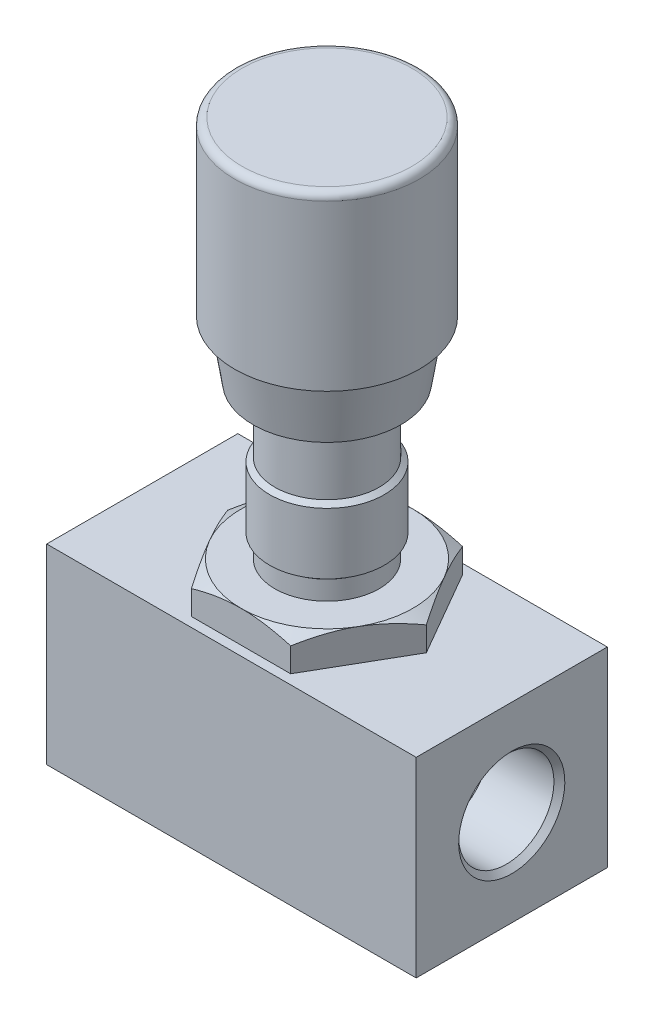
ISO-10303-21;
HEADER;
FILE_DESCRIPTION(('STEP AP214'),'2;1');
FILE_NAME('part.step','',(''),(''),'','','');
FILE_SCHEMA(('AUTOMOTIVE_DESIGN { 1 0 10303 214 1 1 1 1 }'));
ENDSEC;
DATA;
#1=APPLICATION_CONTEXT('core data for automotive mechanical design processes');
#2=APPLICATION_PROTOCOL_DEFINITION('international standard','automotive_design',2000,#1);
#3=PRODUCT_CONTEXT('',#1,'mechanical');
#4=PRODUCT('Part','Part','',(#3));
#5=PRODUCT_RELATED_PRODUCT_CATEGORY('part','',(#4));
#6=PRODUCT_DEFINITION_FORMATION('','',#4);
#7=PRODUCT_DEFINITION_CONTEXT('part definition',#1,'design');
#8=PRODUCT_DEFINITION('design','',#6,#7);
#9=PRODUCT_DEFINITION_SHAPE('','',#8);
#10=(LENGTH_UNIT() NAMED_UNIT(*) SI_UNIT(.MILLI.,.METRE.));
#11=(NAMED_UNIT(*) PLANE_ANGLE_UNIT() SI_UNIT($,.RADIAN.));
#12=(NAMED_UNIT(*) SI_UNIT($,.STERADIAN.) SOLID_ANGLE_UNIT());
#13=UNCERTAINTY_MEASURE_WITH_UNIT(LENGTH_MEASURE(1.E-05),#10,'distance_accuracy_value','');
#14=(GEOMETRIC_REPRESENTATION_CONTEXT(3) GLOBAL_UNCERTAINTY_ASSIGNED_CONTEXT((#13)) GLOBAL_UNIT_ASSIGNED_CONTEXT((#10,
#11,#12)) REPRESENTATION_CONTEXT('',''));
#15=CARTESIAN_POINT('',(0.,0.,0.));
#16=DIRECTION('',(0.,0.,1.));
#17=DIRECTION('',(1.,0.,0.));
#18=AXIS2_PLACEMENT_3D('',#15,#16,#17);
#19=CARTESIAN_POINT('',(29.,0.,0.));
#20=DIRECTION('',(-1.,0.,0.));
#21=DIRECTION('',(0.,0.,1.));
#22=AXIS2_PLACEMENT_3D('',#19,#20,#21);
#23=PLANE('',#22);
#24=DIRECTION('',(0.,0.,-1.));
#25=VECTOR('',#24,1.);
#26=CARTESIAN_POINT('',(29.,-15.,0.));
#27=LINE('',#26,#25);
#28=CARTESIAN_POINT('',(29.,-15.,15.));
#29=VERTEX_POINT('',#28);
#30=CARTESIAN_POINT('',(29.,-15.,-15.));
#31=VERTEX_POINT('',#30);
#32=EDGE_CURVE('E541',#29,#31,#27,.T.);
#33=ORIENTED_EDGE('',*,*,#32,.T.);
#34=DIRECTION('',(0.,-1.,0.));
#35=VECTOR('',#34,1.);
#36=CARTESIAN_POINT('',(29.,0.,-15.));
#37=LINE('',#36,#35);
#38=CARTESIAN_POINT('',(29.,15.,-15.));
#39=VERTEX_POINT('',#38);
#40=EDGE_CURVE('E307',#39,#31,#37,.T.);
#41=ORIENTED_EDGE('',*,*,#40,.F.);
#42=DIRECTION('',(0.,0.,-1.));
#43=VECTOR('',#42,1.);
#44=CARTESIAN_POINT('',(29.,15.,0.));
#45=LINE('',#44,#43);
#46=CARTESIAN_POINT('',(29.,15.,15.));
#47=VERTEX_POINT('',#46);
#48=EDGE_CURVE('E11',#47,#39,#45,.T.);
#49=ORIENTED_EDGE('',*,*,#48,.F.);
#50=DIRECTION('',(0.,1.,0.));
#51=VECTOR('',#50,1.);
#52=CARTESIAN_POINT('',(29.,0.,15.));
#53=LINE('',#52,#51);
#54=EDGE_CURVE('E296',#29,#47,#53,.T.);
#55=ORIENTED_EDGE('',*,*,#54,.F.);
#56=EDGE_LOOP('',(#33,#41,#49,#55));
#57=FACE_BOUND('',#56,.T.);
#58=CARTESIAN_POINT('',(29.,0.,0.));
#59=DIRECTION('',(-1.,0.,0.));
#60=DIRECTION('',(0.,1.,0.));
#61=AXIS2_PLACEMENT_3D('',#58,#59,#60);
#62=CIRCLE('',#61,8.331);
#63=CARTESIAN_POINT('',(29.,8.331,0.));
#64=VERTEX_POINT('',#63);
#65=EDGE_CURVE('E250',#64,#64,#62,.T.);
#66=ORIENTED_EDGE('',*,*,#65,.T.);
#67=EDGE_LOOP('',(#66));
#68=FACE_BOUND('',#67,.T.);
#69=ADVANCED_FACE('F16',(#57,#68),#23,.F.);
#70=CARTESIAN_POINT('',(0.,15.,0.));
#71=DIRECTION('',(0.,-1.,0.));
#72=DIRECTION('',(0.,0.,-1.));
#73=AXIS2_PLACEMENT_3D('',#70,#71,#72);
#74=PLANE('',#73);
#75=ORIENTED_EDGE('',*,*,#48,.T.);
#76=DIRECTION('',(1.,0.,0.));
#77=VECTOR('',#76,1.);
#78=CARTESIAN_POINT('',(0.,15.,-15.));
#79=LINE('',#78,#77);
#80=CARTESIAN_POINT('',(-29.,15.,-15.));
#81=VERTEX_POINT('',#80);
#82=EDGE_CURVE('E405',#81,#39,#79,.T.);
#83=ORIENTED_EDGE('',*,*,#82,.F.);
#84=DIRECTION('',(0.,0.,-1.));
#85=VECTOR('',#84,1.);
#86=CARTESIAN_POINT('',(-29.,15.,0.));
#87=LINE('',#86,#85);
#88=CARTESIAN_POINT('',(-29.,15.,15.));
#89=VERTEX_POINT('',#88);
#90=EDGE_CURVE('E26',#89,#81,#87,.T.);
#91=ORIENTED_EDGE('',*,*,#90,.F.);
#92=DIRECTION('',(-1.,0.,0.));
#93=VECTOR('',#92,1.);
#94=CARTESIAN_POINT('',(0.,15.,15.));
#95=LINE('',#94,#93);
#96=EDGE_CURVE('E540',#47,#89,#95,.T.);
#97=ORIENTED_EDGE('',*,*,#96,.F.);
#98=EDGE_LOOP('',(#75,#83,#91,#97));
#99=FACE_BOUND('',#98,.T.);
#100=DIRECTION('',(-0.5,0.,0.866025403784439));
#101=VECTOR('',#100,1.);
#102=CARTESIAN_POINT('',(11.6913429510899,15.,6.75));
#103=LINE('',#102,#101);
#104=CARTESIAN_POINT('',(15.5884572681199,15.,0.));
#105=VERTEX_POINT('',#104);
#106=CARTESIAN_POINT('',(7.79422863405995,15.,13.5));
#107=VERTEX_POINT('',#106);
#108=EDGE_CURVE('E213',#105,#107,#103,.T.);
#109=ORIENTED_EDGE('',*,*,#108,.T.);
#110=DIRECTION('',(-1.,0.,0.));
#111=VECTOR('',#110,1.);
#112=CARTESIAN_POINT('',(0.,15.,13.5));
#113=LINE('',#112,#111);
#114=CARTESIAN_POINT('',(-7.79422863405996,15.,13.5));
#115=VERTEX_POINT('',#114);
#116=EDGE_CURVE('E152',#107,#115,#113,.T.);
#117=ORIENTED_EDGE('',*,*,#116,.T.);
#118=DIRECTION('',(-0.5,0.,-0.866025403784439));
#119=VECTOR('',#118,1.);
#120=CARTESIAN_POINT('',(-11.6913429510899,15.,6.75));
#121=LINE('',#120,#119);
#122=CARTESIAN_POINT('',(-15.5884572681199,15.,0.));
#123=VERTEX_POINT('',#122);
#124=EDGE_CURVE('E415',#115,#123,#121,.T.);
#125=ORIENTED_EDGE('',*,*,#124,.T.);
#126=DIRECTION('',(0.5,0.,-0.866025403784439));
#127=VECTOR('',#126,1.);
#128=CARTESIAN_POINT('',(-11.6913429510899,15.,-6.75));
#129=LINE('',#128,#127);
#130=CARTESIAN_POINT('',(-7.79422863405994,15.,-13.5));
#131=VERTEX_POINT('',#130);
#132=EDGE_CURVE('E240',#123,#131,#129,.T.);
#133=ORIENTED_EDGE('',*,*,#132,.T.);
#134=DIRECTION('',(1.,0.,0.));
#135=VECTOR('',#134,1.);
#136=CARTESIAN_POINT('',(0.,15.,-13.5));
#137=LINE('',#136,#135);
#138=CARTESIAN_POINT('',(7.79422863405995,15.,-13.5));
#139=VERTEX_POINT('',#138);
#140=EDGE_CURVE('E247',#131,#139,#137,.T.);
#141=ORIENTED_EDGE('',*,*,#140,.T.);
#142=DIRECTION('',(0.5,0.,0.866025403784439));
#143=VECTOR('',#142,1.);
#144=CARTESIAN_POINT('',(11.6913429510899,15.,-6.75));
#145=LINE('',#144,#143);
#146=EDGE_CURVE('E146',#139,#105,#145,.T.);
#147=ORIENTED_EDGE('',*,*,#146,.T.);
#148=EDGE_LOOP('',(#109,#117,#125,#133,#141,#147));
#149=FACE_BOUND('',#148,.T.);
#150=ADVANCED_FACE('F334',(#99,#149),#74,.F.);
#151=CARTESIAN_POINT('',(-29.,0.,0.));
#152=DIRECTION('',(1.,0.,0.));
#153=DIRECTION('',(0.,0.,-1.));
#154=AXIS2_PLACEMENT_3D('',#151,#152,#153);
#155=PLANE('',#154);
#156=ORIENTED_EDGE('',*,*,#90,.T.);
#157=DIRECTION('',(0.,1.,0.));
#158=VECTOR('',#157,1.);
#159=CARTESIAN_POINT('',(-29.,0.,-15.));
#160=LINE('',#159,#158);
#161=CARTESIAN_POINT('',(-29.,-15.,-15.));
#162=VERTEX_POINT('',#161);
#163=EDGE_CURVE('E411',#162,#81,#160,.T.);
#164=ORIENTED_EDGE('',*,*,#163,.F.);
#165=DIRECTION('',(0.,0.,-1.));
#166=VECTOR('',#165,1.);
#167=CARTESIAN_POINT('',(-29.,-15.,0.));
#168=LINE('',#167,#166);
#169=CARTESIAN_POINT('',(-29.,-15.,15.));
#170=VERTEX_POINT('',#169);
#171=EDGE_CURVE('E410',#170,#162,#168,.T.);
#172=ORIENTED_EDGE('',*,*,#171,.F.);
#173=DIRECTION('',(0.,-1.,0.));
#174=VECTOR('',#173,1.);
#175=CARTESIAN_POINT('',(-29.,0.,15.));
#176=LINE('',#175,#174);
#177=EDGE_CURVE('E441',#89,#170,#176,.T.);
#178=ORIENTED_EDGE('',*,*,#177,.F.);
#179=EDGE_LOOP('',(#156,#164,#172,#178));
#180=FACE_BOUND('',#179,.T.);
#181=CARTESIAN_POINT('',(-29.,0.,0.));
#182=DIRECTION('',(1.,0.,0.));
#183=DIRECTION('',(0.,1.,0.));
#184=AXIS2_PLACEMENT_3D('',#181,#182,#183);
#185=CIRCLE('',#184,8.331);
#186=CARTESIAN_POINT('',(-29.,8.331,0.));
#187=VERTEX_POINT('',#186);
#188=EDGE_CURVE('E192',#187,#187,#185,.T.);
#189=ORIENTED_EDGE('',*,*,#188,.T.);
#190=EDGE_LOOP('',(#189));
#191=FACE_BOUND('',#190,.T.);
#192=ADVANCED_FACE('F193',(#180,#191),#155,.F.);
#193=CARTESIAN_POINT('',(0.,-15.,0.));
#194=DIRECTION('',(0.,1.,0.));
#195=DIRECTION('',(0.,0.,1.));
#196=AXIS2_PLACEMENT_3D('',#193,#194,#195);
#197=PLANE('',#196);
#198=ORIENTED_EDGE('',*,*,#171,.T.);
#199=DIRECTION('',(-1.,0.,0.));
#200=VECTOR('',#199,1.);
#201=CARTESIAN_POINT('',(0.,-15.,-15.));
#202=LINE('',#201,#200);
#203=EDGE_CURVE('E309',#31,#162,#202,.T.);
#204=ORIENTED_EDGE('',*,*,#203,.F.);
#205=ORIENTED_EDGE('',*,*,#32,.F.);
#206=DIRECTION('',(1.,0.,0.));
#207=VECTOR('',#206,1.);
#208=CARTESIAN_POINT('',(0.,-15.,15.));
#209=LINE('',#208,#207);
#210=EDGE_CURVE('E310',#170,#29,#209,.T.);
#211=ORIENTED_EDGE('',*,*,#210,.F.);
#212=EDGE_LOOP('',(#198,#204,#205,#211));
#213=FACE_BOUND('',#212,.T.);
#214=ADVANCED_FACE('F606',(#213),#197,.F.);
#215=CARTESIAN_POINT('',(0.,0.,-15.));
#216=DIRECTION('',(0.,0.,1.));
#217=DIRECTION('',(1.,0.,0.));
#218=AXIS2_PLACEMENT_3D('',#215,#216,#217);
#219=PLANE('',#218);
#220=ORIENTED_EDGE('',*,*,#40,.T.);
#221=ORIENTED_EDGE('',*,*,#203,.T.);
#222=ORIENTED_EDGE('',*,*,#163,.T.);
#223=ORIENTED_EDGE('',*,*,#82,.T.);
#224=EDGE_LOOP('',(#220,#221,#222,#223));
#225=FACE_BOUND('',#224,.T.);
#226=ADVANCED_FACE('F370',(#225),#219,.F.);
#227=CARTESIAN_POINT('',(0.,0.,15.));
#228=DIRECTION('',(0.,0.,1.));
#229=DIRECTION('',(1.,0.,0.));
#230=AXIS2_PLACEMENT_3D('',#227,#228,#229);
#231=PLANE('',#230);
#232=ORIENTED_EDGE('',*,*,#54,.T.);
#233=ORIENTED_EDGE('',*,*,#96,.T.);
#234=ORIENTED_EDGE('',*,*,#177,.T.);
#235=ORIENTED_EDGE('',*,*,#210,.T.);
#236=EDGE_LOOP('',(#232,#233,#234,#235));
#237=FACE_BOUND('',#236,.T.);
#238=ADVANCED_FACE('F367',(#237),#231,.T.);
#239=CARTESIAN_POINT('',(0.,0.,0.));
#240=DIRECTION('',(-1.,0.,0.));
#241=DIRECTION('',(0.,0.,-1.));
#242=AXIS2_PLACEMENT_3D('',#239,#240,#241);
#243=CYLINDRICAL_SURFACE('',#242,5.);
#244=CARTESIAN_POINT('',(-15.,0.,0.));
#245=DIRECTION('',(-1.,0.,0.));
#246=DIRECTION('',(0.,0.,-1.));
#247=AXIS2_PLACEMENT_3D('',#244,#245,#246);
#248=CIRCLE('',#247,5.);
#249=CARTESIAN_POINT('',(-15.,0.,5.));
#250=VERTEX_POINT('',#249);
#251=EDGE_CURVE('E20',#250,#250,#248,.T.);
#252=ORIENTED_EDGE('',*,*,#251,.T.);
#253=EDGE_LOOP('',(#252));
#254=FACE_BOUND('',#253,.T.);
#255=CARTESIAN_POINT('',(15.,0.,0.));
#256=DIRECTION('',(1.,0.,0.));
#257=DIRECTION('',(0.,0.,-1.));
#258=AXIS2_PLACEMENT_3D('',#255,#256,#257);
#259=CIRCLE('',#258,5.);
#260=CARTESIAN_POINT('',(15.,0.,5.));
#261=VERTEX_POINT('',#260);
#262=EDGE_CURVE('E251',#261,#261,#259,.T.);
#263=ORIENTED_EDGE('',*,*,#262,.T.);
#264=EDGE_LOOP('',(#263));
#265=FACE_BOUND('',#264,.T.);
#266=ADVANCED_FACE('F369',(#254,#265),#243,.F.);
#267=CARTESIAN_POINT('',(11.6913429510899,14.,-6.75));
#268=DIRECTION('',(0.866025403784439,0.,-0.5));
#269=DIRECTION('',(-0.5,0.,-0.866025403784439));
#270=AXIS2_PLACEMENT_3D('',#267,#268,#269);
#271=PLANE('',#270);
#272=CARTESIAN_POINT('',(15.592498428958,18.7918945617207,0.00699949589312922));
#273=CARTESIAN_POINT('',(13.5016239152978,20.,-3.61450139401712));
#274=CARTESIAN_POINT('',(11.6913429510899,20.,-6.75));
#275=CARTESIAN_POINT('',(9.88106198688201,20.,-9.88549860598287));
#276=CARTESIAN_POINT('',(7.79018747322186,18.7918945617207,-13.5069994958931));
#277=(BOUNDED_CURVE() B_SPLINE_CURVE(2,(#272,#273,#274,#275,#276),.UNSPECIFIED.,.F.,
.F.) B_SPLINE_CURVE_WITH_KNOTS((3,2,3),(0.,7.91547713664417,15.8309542732883),
.UNSPECIFIED.) CURVE() GEOMETRIC_REPRESENTATION_ITEM() RATIONAL_B_SPLINE_CURVE((1.,
1.03802697460134,1.,1.03802697460135,1.)) REPRESENTATION_ITEM(''));
#278=CARTESIAN_POINT('',(15.5884572681199,18.79422863406,0.));
#279=VERTEX_POINT('',#278);
#280=CARTESIAN_POINT('',(11.6913429510899,20.,-6.75));
#281=VERTEX_POINT('',#280);
#282=EDGE_CURVE('E225',#279,#281,#277,.T.);
#283=ORIENTED_EDGE('',*,*,#282,.F.);
#284=DIRECTION('',(0.,1.,0.));
#285=VECTOR('',#284,1.);
#286=CARTESIAN_POINT('',(15.5884572681199,14.,0.));
#287=LINE('',#286,#285);
#288=EDGE_CURVE('E210',#105,#279,#287,.T.);
#289=ORIENTED_EDGE('',*,*,#288,.F.);
#290=ORIENTED_EDGE('',*,*,#146,.F.);
#291=DIRECTION('',(0.,1.,0.));
#292=VECTOR('',#291,1.);
#293=CARTESIAN_POINT('',(7.79422863405995,14.,-13.5));
#294=LINE('',#293,#292);
#295=CARTESIAN_POINT('',(7.79422863405995,18.79422863406,-13.5));
#296=VERTEX_POINT('',#295);
#297=EDGE_CURVE('E249',#139,#296,#294,.T.);
#298=ORIENTED_EDGE('',*,*,#297,.T.);
#299=CARTESIAN_POINT('',(15.592498428958,18.7918945617207,0.00699949589312922));
#300=CARTESIAN_POINT('',(13.5016239152978,20.,-3.61450139401712));
#301=CARTESIAN_POINT('',(11.6913429510899,20.,-6.75));
#302=CARTESIAN_POINT('',(9.88106198688201,20.,-9.88549860598287));
#303=CARTESIAN_POINT('',(7.79018747322186,18.7918945617207,-13.5069994958931));
#304=(BOUNDED_CURVE() B_SPLINE_CURVE(2,(#299,#300,#301,#302,#303),.UNSPECIFIED.,.F.,
.F.) B_SPLINE_CURVE_WITH_KNOTS((3,2,3),(0.,7.91547713664417,15.8309542732883),
.UNSPECIFIED.) CURVE() GEOMETRIC_REPRESENTATION_ITEM() RATIONAL_B_SPLINE_CURVE((1.,
1.03802697460134,1.,1.03802697460135,1.)) REPRESENTATION_ITEM(''));
#305=EDGE_CURVE('E272',#281,#296,#304,.T.);
#306=ORIENTED_EDGE('',*,*,#305,.F.);
#307=EDGE_LOOP('',(#283,#289,#290,#298,#306));
#308=FACE_BOUND('',#307,.T.);
#309=ADVANCED_FACE('F361',(#308),#271,.T.);
#310=CARTESIAN_POINT('',(0.,14.,13.5));
#311=DIRECTION('',(0.,0.,1.));
#312=DIRECTION('',(1.,0.,0.));
#313=AXIS2_PLACEMENT_3D('',#310,#311,#312);
#314=PLANE('',#313);
#315=CARTESIAN_POINT('',(-7.80231095573614,18.7918945617207,13.5));
#316=CARTESIAN_POINT('',(-3.62056192841584,20.,13.5));
#317=CARTESIAN_POINT('',(0.,20.,13.5));
#318=CARTESIAN_POINT('',(3.62056192841583,20.,13.5));
#319=CARTESIAN_POINT('',(7.80231095573614,18.7918945617207,13.5));
#320=(BOUNDED_CURVE() B_SPLINE_CURVE(2,(#315,#316,#317,#318,#319),.UNSPECIFIED.,.F.,
.F.) B_SPLINE_CURVE_WITH_KNOTS((3,2,3),(0.,7.91547713664418,15.8309542732883),
.UNSPECIFIED.) CURVE() GEOMETRIC_REPRESENTATION_ITEM() RATIONAL_B_SPLINE_CURVE((1.,
1.03802697460135,1.,1.03802697460135,1.)) REPRESENTATION_ITEM(''));
#321=CARTESIAN_POINT('',(-7.79422863405996,18.79422863406,13.5));
#322=VERTEX_POINT('',#321);
#323=CARTESIAN_POINT('',(0.,20.,13.5));
#324=VERTEX_POINT('',#323);
#325=EDGE_CURVE('E269',#322,#324,#320,.T.);
#326=ORIENTED_EDGE('',*,*,#325,.F.);
#327=DIRECTION('',(0.,1.,0.));
#328=VECTOR('',#327,1.);
#329=CARTESIAN_POINT('',(-7.79422863405996,14.,13.5));
#330=LINE('',#329,#328);
#331=EDGE_CURVE('E413',#115,#322,#330,.T.);
#332=ORIENTED_EDGE('',*,*,#331,.F.);
#333=ORIENTED_EDGE('',*,*,#116,.F.);
#334=DIRECTION('',(0.,1.,0.));
#335=VECTOR('',#334,1.);
#336=CARTESIAN_POINT('',(7.79422863405995,14.,13.5));
#337=LINE('',#336,#335);
#338=CARTESIAN_POINT('',(7.79422863405995,18.79422863406,13.5));
#339=VERTEX_POINT('',#338);
#340=EDGE_CURVE('E248',#107,#339,#337,.T.);
#341=ORIENTED_EDGE('',*,*,#340,.T.);
#342=CARTESIAN_POINT('',(-7.80231095573614,18.7918945617207,13.5));
#343=CARTESIAN_POINT('',(-3.62056192841584,20.,13.5));
#344=CARTESIAN_POINT('',(0.,20.,13.5));
#345=CARTESIAN_POINT('',(3.62056192841583,20.,13.5));
#346=CARTESIAN_POINT('',(7.80231095573614,18.7918945617207,13.5));
#347=(BOUNDED_CURVE() B_SPLINE_CURVE(2,(#342,#343,#344,#345,#346),.UNSPECIFIED.,.F.,
.F.) B_SPLINE_CURVE_WITH_KNOTS((3,2,3),(0.,7.91547713664418,15.8309542732883),
.UNSPECIFIED.) CURVE() GEOMETRIC_REPRESENTATION_ITEM() RATIONAL_B_SPLINE_CURVE((1.,
1.03802697460135,1.,1.03802697460135,1.)) REPRESENTATION_ITEM(''));
#348=EDGE_CURVE('E276',#324,#339,#347,.T.);
#349=ORIENTED_EDGE('',*,*,#348,.F.);
#350=EDGE_LOOP('',(#326,#332,#333,#341,#349));
#351=FACE_BOUND('',#350,.T.);
#352=ADVANCED_FACE('F357',(#351),#314,.T.);
#353=CARTESIAN_POINT('',(11.6913429510899,14.,6.75));
#354=DIRECTION('',(0.866025403784439,0.,0.5));
#355=DIRECTION('',(0.5,0.,-0.866025403784439));
#356=AXIS2_PLACEMENT_3D('',#353,#354,#355);
#357=PLANE('',#356);
#358=CARTESIAN_POINT('',(7.79018747322186,18.7918945617207,13.5069994958931));
#359=CARTESIAN_POINT('',(9.88106198688203,20.,9.88549860598287));
#360=CARTESIAN_POINT('',(11.6913429510899,20.,6.75));
#361=CARTESIAN_POINT('',(13.5016239152978,20.,3.61450139401713));
#362=CARTESIAN_POINT('',(15.592498428958,18.7918945617207,-0.00699949589312445));
#363=(BOUNDED_CURVE() B_SPLINE_CURVE(2,(#358,#359,#360,#361,#362),.UNSPECIFIED.,.F.,
.F.) B_SPLINE_CURVE_WITH_KNOTS((3,2,3),(0.,7.91547713664417,15.8309542732883),
.UNSPECIFIED.) CURVE() GEOMETRIC_REPRESENTATION_ITEM() RATIONAL_B_SPLINE_CURVE((1.,
1.03802697460134,1.,1.03802697460134,1.)) REPRESENTATION_ITEM(''));
#364=CARTESIAN_POINT('',(11.6913429510899,20.,6.75));
#365=VERTEX_POINT('',#364);
#366=EDGE_CURVE('E285',#339,#365,#363,.T.);
#367=ORIENTED_EDGE('',*,*,#366,.F.);
#368=ORIENTED_EDGE('',*,*,#340,.F.);
#369=ORIENTED_EDGE('',*,*,#108,.F.);
#370=ORIENTED_EDGE('',*,*,#288,.T.);
#371=CARTESIAN_POINT('',(7.79018747322186,18.7918945617207,13.5069994958931));
#372=CARTESIAN_POINT('',(9.88106198688203,20.,9.88549860598287));
#373=CARTESIAN_POINT('',(11.6913429510899,20.,6.75));
#374=CARTESIAN_POINT('',(13.5016239152978,20.,3.61450139401713));
#375=CARTESIAN_POINT('',(15.592498428958,18.7918945617207,-0.00699949589312445));
#376=(BOUNDED_CURVE() B_SPLINE_CURVE(2,(#371,#372,#373,#374,#375),.UNSPECIFIED.,.F.,
.F.) B_SPLINE_CURVE_WITH_KNOTS((3,2,3),(0.,7.91547713664417,15.8309542732883),
.UNSPECIFIED.) CURVE() GEOMETRIC_REPRESENTATION_ITEM() RATIONAL_B_SPLINE_CURVE((1.,
1.03802697460134,1.,1.03802697460134,1.)) REPRESENTATION_ITEM(''));
#377=EDGE_CURVE('E231',#365,#279,#376,.T.);
#378=ORIENTED_EDGE('',*,*,#377,.F.);
#379=EDGE_LOOP('',(#367,#368,#369,#370,#378));
#380=FACE_BOUND('',#379,.T.);
#381=ADVANCED_FACE('F360',(#380),#357,.T.);
#382=CARTESIAN_POINT('',(0.,14.,-13.5));
#383=DIRECTION('',(0.,0.,-1.));
#384=DIRECTION('',(-1.,0.,0.));
#385=AXIS2_PLACEMENT_3D('',#382,#383,#384);
#386=PLANE('',#385);
#387=CARTESIAN_POINT('',(7.80231095573613,18.7918945617207,-13.5));
#388=CARTESIAN_POINT('',(3.62056192841584,20.,-13.5));
#389=CARTESIAN_POINT('',(0.,20.,-13.5));
#390=CARTESIAN_POINT('',(-3.62056192841584,20.,-13.5));
#391=CARTESIAN_POINT('',(-7.80231095573613,18.7918945617207,-13.5));
#392=(BOUNDED_CURVE() B_SPLINE_CURVE(2,(#387,#388,#389,#390,#391),.UNSPECIFIED.,.F.,
.F.) B_SPLINE_CURVE_WITH_KNOTS((3,2,3),(0.,7.91547713664417,15.8309542732883),
.UNSPECIFIED.) CURVE() GEOMETRIC_REPRESENTATION_ITEM() RATIONAL_B_SPLINE_CURVE((1.,
1.03802697460135,1.,1.03802697460135,1.)) REPRESENTATION_ITEM(''));
#393=CARTESIAN_POINT('',(0.,20.,-13.5));
#394=VERTEX_POINT('',#393);
#395=CARTESIAN_POINT('',(-7.79422863405994,18.79422863406,-13.5));
#396=VERTEX_POINT('',#395);
#397=EDGE_CURVE('E394',#394,#396,#392,.T.);
#398=ORIENTED_EDGE('',*,*,#397,.F.);
#399=CARTESIAN_POINT('',(7.80231095573613,18.7918945617207,-13.5));
#400=CARTESIAN_POINT('',(3.62056192841584,20.,-13.5));
#401=CARTESIAN_POINT('',(0.,20.,-13.5));
#402=CARTESIAN_POINT('',(-3.62056192841584,20.,-13.5));
#403=CARTESIAN_POINT('',(-7.80231095573613,18.7918945617207,-13.5));
#404=(BOUNDED_CURVE() B_SPLINE_CURVE(2,(#399,#400,#401,#402,#403),.UNSPECIFIED.,.F.,
.F.) B_SPLINE_CURVE_WITH_KNOTS((3,2,3),(0.,7.91547713664417,15.8309542732883),
.UNSPECIFIED.) CURVE() GEOMETRIC_REPRESENTATION_ITEM() RATIONAL_B_SPLINE_CURVE((1.,
1.03802697460135,1.,1.03802697460135,1.)) REPRESENTATION_ITEM(''));
#405=EDGE_CURVE('E238',#296,#394,#404,.T.);
#406=ORIENTED_EDGE('',*,*,#405,.F.);
#407=ORIENTED_EDGE('',*,*,#297,.F.);
#408=ORIENTED_EDGE('',*,*,#140,.F.);
#409=DIRECTION('',(0.,1.,0.));
#410=VECTOR('',#409,1.);
#411=CARTESIAN_POINT('',(-7.79422863405994,14.,-13.5));
#412=LINE('',#411,#410);
#413=EDGE_CURVE('E237',#131,#396,#412,.T.);
#414=ORIENTED_EDGE('',*,*,#413,.T.);
#415=EDGE_LOOP('',(#398,#406,#407,#408,#414));
#416=FACE_BOUND('',#415,.T.);
#417=ADVANCED_FACE('F573',(#416),#386,.T.);
#418=CARTESIAN_POINT('',(-11.6913429510899,14.,6.75));
#419=DIRECTION('',(-0.866025403784439,0.,0.5));
#420=DIRECTION('',(0.5,0.,0.866025403784439));
#421=AXIS2_PLACEMENT_3D('',#418,#419,#420);
#422=PLANE('',#421);
#423=CARTESIAN_POINT('',(-15.592498428958,18.7918945617207,-0.00699949589313398));
#424=CARTESIAN_POINT('',(-13.5016239152979,20.,3.61450139401711));
#425=CARTESIAN_POINT('',(-11.6913429510899,20.,6.75));
#426=CARTESIAN_POINT('',(-9.88106198688201,20.,9.88549860598288));
#427=CARTESIAN_POINT('',(-7.79018747322187,18.7918945617207,13.5069994958931));
#428=(BOUNDED_CURVE() B_SPLINE_CURVE(2,(#423,#424,#425,#426,#427),.UNSPECIFIED.,.F.,
.F.) B_SPLINE_CURVE_WITH_KNOTS((3,2,3),(0.,7.91547713664417,15.8309542732883),
.UNSPECIFIED.) CURVE() GEOMETRIC_REPRESENTATION_ITEM() RATIONAL_B_SPLINE_CURVE((1.,
1.03802697460133,1.,1.03802697460132,1.)) REPRESENTATION_ITEM(''));
#429=CARTESIAN_POINT('',(-11.6913429510899,20.,6.75));
#430=VERTEX_POINT('',#429);
#431=EDGE_CURVE('E268',#430,#322,#428,.T.);
#432=ORIENTED_EDGE('',*,*,#431,.F.);
#433=CARTESIAN_POINT('',(-15.592498428958,18.7918945617207,-0.00699949589313398));
#434=CARTESIAN_POINT('',(-13.5016239152979,20.,3.61450139401711));
#435=CARTESIAN_POINT('',(-11.6913429510899,20.,6.75));
#436=CARTESIAN_POINT('',(-9.88106198688201,20.,9.88549860598288));
#437=CARTESIAN_POINT('',(-7.79018747322187,18.7918945617207,13.5069994958931));
#438=(BOUNDED_CURVE() B_SPLINE_CURVE(2,(#433,#434,#435,#436,#437),.UNSPECIFIED.,.F.,
.F.) B_SPLINE_CURVE_WITH_KNOTS((3,2,3),(0.,7.91547713664417,15.8309542732883),
.UNSPECIFIED.) CURVE() GEOMETRIC_REPRESENTATION_ITEM() RATIONAL_B_SPLINE_CURVE((1.,
1.03802697460133,1.,1.03802697460132,1.)) REPRESENTATION_ITEM(''));
#439=CARTESIAN_POINT('',(-15.5884572681199,18.79422863406,0.));
#440=VERTEX_POINT('',#439);
#441=EDGE_CURVE('E389',#440,#430,#438,.T.);
#442=ORIENTED_EDGE('',*,*,#441,.F.);
#443=DIRECTION('',(0.,1.,0.));
#444=VECTOR('',#443,1.);
#445=CARTESIAN_POINT('',(-15.5884572681199,14.,0.));
#446=LINE('',#445,#444);
#447=EDGE_CURVE('E403',#123,#440,#446,.T.);
#448=ORIENTED_EDGE('',*,*,#447,.F.);
#449=ORIENTED_EDGE('',*,*,#124,.F.);
#450=ORIENTED_EDGE('',*,*,#331,.T.);
#451=EDGE_LOOP('',(#432,#442,#448,#449,#450));
#452=FACE_BOUND('',#451,.T.);
#453=ADVANCED_FACE('F579',(#452),#422,.T.);
#454=CARTESIAN_POINT('',(-11.6913429510899,14.,-6.75));
#455=DIRECTION('',(-0.866025403784438,0.,-0.5));
#456=DIRECTION('',(-0.5,0.,0.866025403784439));
#457=AXIS2_PLACEMENT_3D('',#454,#455,#456);
#458=PLANE('',#457);
#459=CARTESIAN_POINT('',(-7.79018747322185,18.7918945617207,-13.5069994958931));
#460=CARTESIAN_POINT('',(-9.88106198688199,20.,-9.88549860598289));
#461=CARTESIAN_POINT('',(-11.6913429510899,20.,-6.75));
#462=CARTESIAN_POINT('',(-13.5016239152978,20.,-3.61450139401711));
#463=CARTESIAN_POINT('',(-15.592498428958,18.7918945617207,0.00699949589312636));
#464=(BOUNDED_CURVE() B_SPLINE_CURVE(2,(#459,#460,#461,#462,#463),.UNSPECIFIED.,.F.,
.F.) B_SPLINE_CURVE_WITH_KNOTS((3,2,3),(0.,7.91547713664417,15.8309542732883),
.UNSPECIFIED.) CURVE() GEOMETRIC_REPRESENTATION_ITEM() RATIONAL_B_SPLINE_CURVE((1.,
1.03802697460134,1.,1.03802697460134,1.)) REPRESENTATION_ITEM(''));
#465=CARTESIAN_POINT('',(-11.6913429510899,20.,-6.75));
#466=VERTEX_POINT('',#465);
#467=EDGE_CURVE('E261',#466,#440,#464,.T.);
#468=ORIENTED_EDGE('',*,*,#467,.F.);
#469=CARTESIAN_POINT('',(-7.79018747322185,18.7918945617207,-13.5069994958931));
#470=CARTESIAN_POINT('',(-9.88106198688199,20.,-9.88549860598289));
#471=CARTESIAN_POINT('',(-11.6913429510899,20.,-6.75));
#472=CARTESIAN_POINT('',(-13.5016239152978,20.,-3.61450139401711));
#473=CARTESIAN_POINT('',(-15.592498428958,18.7918945617207,0.00699949589312636));
#474=(BOUNDED_CURVE() B_SPLINE_CURVE(2,(#469,#470,#471,#472,#473),.UNSPECIFIED.,.F.,
.F.) B_SPLINE_CURVE_WITH_KNOTS((3,2,3),(0.,7.91547713664417,15.8309542732883),
.UNSPECIFIED.) CURVE() GEOMETRIC_REPRESENTATION_ITEM() RATIONAL_B_SPLINE_CURVE((1.,
1.03802697460134,1.,1.03802697460134,1.)) REPRESENTATION_ITEM(''));
#475=EDGE_CURVE('E243',#396,#466,#474,.T.);
#476=ORIENTED_EDGE('',*,*,#475,.F.);
#477=ORIENTED_EDGE('',*,*,#413,.F.);
#478=ORIENTED_EDGE('',*,*,#132,.F.);
#479=ORIENTED_EDGE('',*,*,#447,.T.);
#480=EDGE_LOOP('',(#468,#476,#477,#478,#479));
#481=FACE_BOUND('',#480,.T.);
#482=ADVANCED_FACE('F355',(#481),#458,.T.);
#483=CARTESIAN_POINT('',(7.,20.,0.));
#484=DIRECTION('',(0.,1.,0.));
#485=DIRECTION('',(1.,0.,0.));
#486=AXIS2_PLACEMENT_3D('',#483,#484,#485);
#487=PLANE('',#486);
#488=CARTESIAN_POINT('',(0.,20.,0.));
#489=DIRECTION('',(0.,1.,0.));
#490=DIRECTION('',(1.,0.,0.));
#491=AXIS2_PLACEMENT_3D('',#488,#489,#490);
#492=CIRCLE('',#491,13.5);
#493=EDGE_CURVE('E230',#365,#281,#492,.T.);
#494=ORIENTED_EDGE('',*,*,#493,.T.);
#495=CARTESIAN_POINT('',(0.,20.,0.));
#496=DIRECTION('',(0.,1.,0.));
#497=DIRECTION('',(1.,0.,0.));
#498=AXIS2_PLACEMENT_3D('',#495,#496,#497);
#499=CIRCLE('',#498,13.5);
#500=EDGE_CURVE('E232',#281,#394,#499,.T.);
#501=ORIENTED_EDGE('',*,*,#500,.T.);
#502=CARTESIAN_POINT('',(0.,20.,0.));
#503=DIRECTION('',(0.,1.,0.));
#504=DIRECTION('',(1.,0.,0.));
#505=AXIS2_PLACEMENT_3D('',#502,#503,#504);
#506=CIRCLE('',#505,13.5);
#507=EDGE_CURVE('E397',#394,#466,#506,.T.);
#508=ORIENTED_EDGE('',*,*,#507,.T.);
#509=CARTESIAN_POINT('',(0.,20.,0.));
#510=DIRECTION('',(0.,1.,0.));
#511=DIRECTION('',(1.,0.,0.));
#512=AXIS2_PLACEMENT_3D('',#509,#510,#511);
#513=CIRCLE('',#512,13.5);
#514=EDGE_CURVE('E202',#466,#430,#513,.T.);
#515=ORIENTED_EDGE('',*,*,#514,.T.);
#516=CARTESIAN_POINT('',(0.,20.,0.));
#517=DIRECTION('',(0.,1.,0.));
#518=DIRECTION('',(1.,0.,0.));
#519=AXIS2_PLACEMENT_3D('',#516,#517,#518);
#520=CIRCLE('',#519,13.5);
#521=EDGE_CURVE('E265',#430,#324,#520,.T.);
#522=ORIENTED_EDGE('',*,*,#521,.T.);
#523=CARTESIAN_POINT('',(0.,20.,0.));
#524=DIRECTION('',(0.,1.,0.));
#525=DIRECTION('',(1.,0.,0.));
#526=AXIS2_PLACEMENT_3D('',#523,#524,#525);
#527=CIRCLE('',#526,13.5);
#528=EDGE_CURVE('E290',#324,#365,#527,.T.);
#529=ORIENTED_EDGE('',*,*,#528,.T.);
#530=EDGE_LOOP('',(#494,#501,#508,#515,#522,#529));
#531=FACE_BOUND('',#530,.T.);
#532=CARTESIAN_POINT('',(0.,20.,0.));
#533=DIRECTION('',(0.,-1.,0.));
#534=DIRECTION('',(-1.,0.,0.));
#535=AXIS2_PLACEMENT_3D('',#532,#533,#534);
#536=CIRCLE('',#535,8.188125);
#537=CARTESIAN_POINT('',(8.188125,20.,0.));
#538=VERTEX_POINT('',#537);
#539=EDGE_CURVE('E223',#538,#538,#536,.T.);
#540=ORIENTED_EDGE('',*,*,#539,.T.);
#541=EDGE_LOOP('',(#540));
#542=FACE_BOUND('',#541,.T.);
#543=ADVANCED_FACE('F351',(#531,#542),#487,.T.);
#544=CARTESIAN_POINT('',(0.,19.3959472808603,0.));
#545=DIRECTION('',(0.,-1.,0.));
#546=DIRECTION('',(1.,0.,0.));
#547=AXIS2_PLACEMENT_3D('',#544,#545,#546);
#548=CONICAL_SURFACE('',#547,14.54625,1.0471975511966);
#549=ORIENTED_EDGE('',*,*,#305,.T.);
#550=ORIENTED_EDGE('',*,*,#405,.T.);
#551=ORIENTED_EDGE('',*,*,#500,.F.);
#552=EDGE_LOOP('',(#549,#550,#551));
#553=FACE_BOUND('',#552,.T.);
#554=ADVANCED_FACE('F354',(#553),#548,.T.);
#555=CARTESIAN_POINT('',(0.,19.3959472808603,0.));
#556=DIRECTION('',(0.,-1.,0.));
#557=DIRECTION('',(1.,0.,0.));
#558=AXIS2_PLACEMENT_3D('',#555,#556,#557);
#559=CONICAL_SURFACE('',#558,14.54625,1.0471975511966);
#560=ORIENTED_EDGE('',*,*,#377,.T.);
#561=ORIENTED_EDGE('',*,*,#282,.T.);
#562=ORIENTED_EDGE('',*,*,#493,.F.);
#563=EDGE_LOOP('',(#560,#561,#562));
#564=FACE_BOUND('',#563,.T.);
#565=ADVANCED_FACE('F473',(#564),#559,.T.);
#566=CARTESIAN_POINT('',(0.,19.3959472808603,0.));
#567=DIRECTION('',(0.,-1.,0.));
#568=DIRECTION('',(1.,0.,0.));
#569=AXIS2_PLACEMENT_3D('',#566,#567,#568);
#570=CONICAL_SURFACE('',#569,14.54625,1.0471975511966);
#571=ORIENTED_EDGE('',*,*,#348,.T.);
#572=ORIENTED_EDGE('',*,*,#366,.T.);
#573=ORIENTED_EDGE('',*,*,#528,.F.);
#574=EDGE_LOOP('',(#571,#572,#573));
#575=FACE_BOUND('',#574,.T.);
#576=ADVANCED_FACE('F383',(#575),#570,.T.);
#577=CARTESIAN_POINT('',(0.,19.3959472808603,0.));
#578=DIRECTION('',(0.,-1.,0.));
#579=DIRECTION('',(1.,0.,0.));
#580=AXIS2_PLACEMENT_3D('',#577,#578,#579);
#581=CONICAL_SURFACE('',#580,14.54625,1.0471975511966);
#582=ORIENTED_EDGE('',*,*,#325,.T.);
#583=ORIENTED_EDGE('',*,*,#521,.F.);
#584=ORIENTED_EDGE('',*,*,#431,.T.);
#585=EDGE_LOOP('',(#582,#583,#584));
#586=FACE_BOUND('',#585,.T.);
#587=ADVANCED_FACE('F375',(#586),#581,.T.);
#588=CARTESIAN_POINT('',(0.,19.3959472808603,0.));
#589=DIRECTION('',(0.,-1.,0.));
#590=DIRECTION('',(1.,0.,0.));
#591=AXIS2_PLACEMENT_3D('',#588,#589,#590);
#592=CONICAL_SURFACE('',#591,14.54625,1.0471975511966);
#593=ORIENTED_EDGE('',*,*,#441,.T.);
#594=ORIENTED_EDGE('',*,*,#514,.F.);
#595=ORIENTED_EDGE('',*,*,#467,.T.);
#596=EDGE_LOOP('',(#593,#594,#595));
#597=FACE_BOUND('',#596,.T.);
#598=ADVANCED_FACE('F372',(#597),#592,.T.);
#599=CARTESIAN_POINT('',(0.,19.3959472808603,0.));
#600=DIRECTION('',(0.,-1.,0.));
#601=DIRECTION('',(1.,0.,0.));
#602=AXIS2_PLACEMENT_3D('',#599,#600,#601);
#603=CONICAL_SURFACE('',#602,14.54625,1.0471975511966);
#604=ORIENTED_EDGE('',*,*,#475,.T.);
#605=ORIENTED_EDGE('',*,*,#507,.F.);
#606=ORIENTED_EDGE('',*,*,#397,.T.);
#607=EDGE_LOOP('',(#604,#605,#606));
#608=FACE_BOUND('',#607,.T.);
#609=ADVANCED_FACE('F374',(#608),#603,.T.);
#610=CARTESIAN_POINT('',(0.,23.3,0.));
#611=DIRECTION('',(0.,1.,0.));
#612=DIRECTION('',(-1.,0.,0.));
#613=AXIS2_PLACEMENT_3D('',#610,#611,#612);
#614=CONICAL_SURFACE('',#613,8.5940625,0.934353050288626);
#615=CARTESIAN_POINT('',(0.,23.6,0.));
#616=DIRECTION('',(0.,-1.,0.));
#617=DIRECTION('',(-1.,0.,0.));
#618=AXIS2_PLACEMENT_3D('',#615,#616,#617);
#619=CIRCLE('',#618,9.);
#620=CARTESIAN_POINT('',(-9.,23.6,0.));
#621=VERTEX_POINT('',#620);
#622=EDGE_CURVE('E241',#621,#621,#619,.T.);
#623=ORIENTED_EDGE('',*,*,#622,.T.);
#624=EDGE_LOOP('',(#623));
#625=FACE_BOUND('',#624,.T.);
#626=CARTESIAN_POINT('',(0.,23.,0.));
#627=DIRECTION('',(0.,-1.,0.));
#628=DIRECTION('',(-1.,0.,0.));
#629=AXIS2_PLACEMENT_3D('',#626,#627,#628);
#630=CIRCLE('',#629,8.188125);
#631=CARTESIAN_POINT('',(-8.188125,23.,0.));
#632=VERTEX_POINT('',#631);
#633=EDGE_CURVE('E221',#632,#632,#630,.T.);
#634=ORIENTED_EDGE('',*,*,#633,.F.);
#635=EDGE_LOOP('',(#634));
#636=FACE_BOUND('',#635,.T.);
#637=ADVANCED_FACE('F365',(#625,#636),#614,.T.);
#638=CARTESIAN_POINT('',(0.,26.,0.));
#639=DIRECTION('',(0.,1.,0.));
#640=DIRECTION('',(-1.,0.,0.));
#641=AXIS2_PLACEMENT_3D('',#638,#639,#640);
#642=CYLINDRICAL_SURFACE('',#641,9.);
#643=ORIENTED_EDGE('',*,*,#622,.F.);
#644=EDGE_LOOP('',(#643));
#645=FACE_BOUND('',#644,.T.);
#646=CARTESIAN_POINT('',(0.,33.2,0.));
#647=DIRECTION('',(0.,1.,0.));
#648=DIRECTION('',(-1.,0.,0.));
#649=AXIS2_PLACEMENT_3D('',#646,#647,#648);
#650=CIRCLE('',#649,9.);
#651=CARTESIAN_POINT('',(-9.,33.2,0.));
#652=VERTEX_POINT('',#651);
#653=EDGE_CURVE('E224',#652,#652,#650,.T.);
#654=ORIENTED_EDGE('',*,*,#653,.F.);
#655=EDGE_LOOP('',(#654));
#656=FACE_BOUND('',#655,.T.);
#657=ADVANCED_FACE('F362',(#645,#656),#642,.T.);
#658=CARTESIAN_POINT('',(0.,19.,0.));
#659=DIRECTION('',(0.,1.,0.));
#660=DIRECTION('',(-1.,0.,0.));
#661=AXIS2_PLACEMENT_3D('',#658,#659,#660);
#662=CYLINDRICAL_SURFACE('',#661,8.188125);
#663=ORIENTED_EDGE('',*,*,#539,.F.);
#664=EDGE_LOOP('',(#663));
#665=FACE_BOUND('',#664,.T.);
#666=ORIENTED_EDGE('',*,*,#633,.T.);
#667=EDGE_LOOP('',(#666));
#668=FACE_BOUND('',#667,.T.);
#669=ADVANCED_FACE('F348',(#665,#668),#662,.T.);
#670=CARTESIAN_POINT('',(0.,37.8,0.));
#671=DIRECTION('',(0.,-1.,0.));
#672=DIRECTION('',(-1.,0.,0.));
#673=AXIS2_PLACEMENT_3D('',#670,#671,#672);
#674=CYLINDRICAL_SURFACE('',#673,8.188125);
#675=CARTESIAN_POINT('',(0.,33.8,0.));
#676=DIRECTION('',(0.,1.,0.));
#677=DIRECTION('',(-1.,0.,0.));
#678=AXIS2_PLACEMENT_3D('',#675,#676,#677);
#679=CIRCLE('',#678,8.188125);
#680=CARTESIAN_POINT('',(-8.188125,33.8,0.));
#681=VERTEX_POINT('',#680);
#682=EDGE_CURVE('E208',#681,#681,#679,.T.);
#683=ORIENTED_EDGE('',*,*,#682,.T.);
#684=EDGE_LOOP('',(#683));
#685=FACE_BOUND('',#684,.T.);
#686=CARTESIAN_POINT('',(0.,44.,0.));
#687=DIRECTION('',(0.,-1.,0.));
#688=DIRECTION('',(-1.,0.,0.));
#689=AXIS2_PLACEMENT_3D('',#686,#687,#688);
#690=CIRCLE('',#689,8.188125);
#691=CARTESIAN_POINT('',(8.188125,44.,0.));
#692=VERTEX_POINT('',#691);
#693=EDGE_CURVE('E205',#692,#692,#690,.T.);
#694=ORIENTED_EDGE('',*,*,#693,.T.);
#695=EDGE_LOOP('',(#694));
#696=FACE_BOUND('',#695,.T.);
#697=ADVANCED_FACE('F345',(#685,#696),#674,.T.);
#698=CARTESIAN_POINT('',(0.,33.5,0.));
#699=DIRECTION('',(0.,-1.,0.));
#700=DIRECTION('',(-1.,0.,0.));
#701=AXIS2_PLACEMENT_3D('',#698,#699,#700);
#702=CONICAL_SURFACE('',#701,8.5940625,0.934353050288626);
#703=ORIENTED_EDGE('',*,*,#653,.T.);
#704=EDGE_LOOP('',(#703));
#705=FACE_BOUND('',#704,.T.);
#706=ORIENTED_EDGE('',*,*,#682,.F.);
#707=EDGE_LOOP('',(#706));
#708=FACE_BOUND('',#707,.T.);
#709=ADVANCED_FACE('F347',(#705,#708),#702,.T.);
#710=CARTESIAN_POINT('',(0.,48.5,0.));
#711=DIRECTION('',(0.,1.,0.));
#712=DIRECTION('',(-1.,0.,0.));
#713=AXIS2_PLACEMENT_3D('',#710,#711,#712);
#714=CONICAL_SURFACE('',#713,12.325,0.159738450670912);
#715=CARTESIAN_POINT('',(0.,53.,0.));
#716=DIRECTION('',(0.,-1.,0.));
#717=DIRECTION('',(-1.,0.,0.));
#718=AXIS2_PLACEMENT_3D('',#715,#716,#717);
#719=CIRCLE('',#718,13.05);
#720=CARTESIAN_POINT('',(-13.05,53.,0.));
#721=VERTEX_POINT('',#720);
#722=EDGE_CURVE('E206',#721,#721,#719,.T.);
#723=ORIENTED_EDGE('',*,*,#722,.T.);
#724=EDGE_LOOP('',(#723));
#725=FACE_BOUND('',#724,.T.);
#726=CARTESIAN_POINT('',(0.,44.,0.));
#727=DIRECTION('',(0.,-1.,0.));
#728=DIRECTION('',(-1.,0.,0.));
#729=AXIS2_PLACEMENT_3D('',#726,#727,#728);
#730=CIRCLE('',#729,11.6);
#731=CARTESIAN_POINT('',(-11.6,44.,0.));
#732=VERTEX_POINT('',#731);
#733=EDGE_CURVE('E197',#732,#732,#730,.T.);
#734=ORIENTED_EDGE('',*,*,#733,.F.);
#735=EDGE_LOOP('',(#734));
#736=FACE_BOUND('',#735,.T.);
#737=ADVANCED_FACE('F459',(#725,#736),#714,.T.);
#738=CARTESIAN_POINT('',(0.,80.,0.));
#739=DIRECTION('',(0.,1.,0.));
#740=DIRECTION('',(1.,0.,0.));
#741=AXIS2_PLACEMENT_3D('',#738,#739,#740);
#742=PLANE('',#741);
#743=CARTESIAN_POINT('',(0.,80.,0.));
#744=DIRECTION('',(0.,1.,0.));
#745=DIRECTION('',(1.,0.,0.));
#746=AXIS2_PLACEMENT_3D('',#743,#744,#745);
#747=CIRCLE('',#746,13.34);
#748=CARTESIAN_POINT('',(13.34,80.,0.));
#749=VERTEX_POINT('',#748);
#750=EDGE_CURVE('E216',#749,#749,#747,.T.);
#751=ORIENTED_EDGE('',*,*,#750,.T.);
#752=EDGE_LOOP('',(#751));
#753=FACE_BOUND('',#752,.T.);
#754=ADVANCED_FACE('F465',(#753),#742,.T.);
#755=CARTESIAN_POINT('',(0.,53.,0.));
#756=DIRECTION('',(0.,-1.,0.));
#757=DIRECTION('',(-1.,0.,0.));
#758=AXIS2_PLACEMENT_3D('',#755,#756,#757);
#759=PLANE('',#758);
#760=ORIENTED_EDGE('',*,*,#722,.F.);
#761=EDGE_LOOP('',(#760));
#762=FACE_BOUND('',#761,.T.);
#763=CARTESIAN_POINT('',(0.,53.,0.));
#764=DIRECTION('',(0.,-1.,0.));
#765=DIRECTION('',(1.,0.,0.));
#766=AXIS2_PLACEMENT_3D('',#763,#764,#765);
#767=CIRCLE('',#766,14.5);
#768=CARTESIAN_POINT('',(14.5,53.,0.));
#769=VERTEX_POINT('',#768);
#770=EDGE_CURVE('E209',#769,#769,#767,.T.);
#771=ORIENTED_EDGE('',*,*,#770,.T.);
#772=EDGE_LOOP('',(#771));
#773=FACE_BOUND('',#772,.T.);
#774=ADVANCED_FACE('F506',(#762,#773),#759,.T.);
#775=CARTESIAN_POINT('',(0.,66.5,0.));
#776=DIRECTION('',(0.,-1.,0.));
#777=DIRECTION('',(1.,0.,0.));
#778=AXIS2_PLACEMENT_3D('',#775,#776,#777);
#779=CYLINDRICAL_SURFACE('',#778,14.5);
#780=CARTESIAN_POINT('',(0.,78.84,0.));
#781=DIRECTION('',(0.,1.,0.));
#782=DIRECTION('',(1.,0.,0.));
#783=AXIS2_PLACEMENT_3D('',#780,#781,#782);
#784=CIRCLE('',#783,14.5);
#785=CARTESIAN_POINT('',(14.5,78.84,0.));
#786=VERTEX_POINT('',#785);
#787=EDGE_CURVE('E429',#786,#786,#784,.T.);
#788=ORIENTED_EDGE('',*,*,#787,.F.);
#789=EDGE_LOOP('',(#788));
#790=FACE_BOUND('',#789,.T.);
#791=ORIENTED_EDGE('',*,*,#770,.F.);
#792=EDGE_LOOP('',(#791));
#793=FACE_BOUND('',#792,.T.);
#794=ADVANCED_FACE('F502',(#790,#793),#779,.T.);
#795=CARTESIAN_POINT('',(0.,78.84,0.));
#796=DIRECTION('',(0.,1.,0.));
#797=DIRECTION('',(0.,0.,1.));
#798=AXIS2_PLACEMENT_3D('',#795,#796,#797);
#799=TOROIDAL_SURFACE('',#798,13.34,1.16);
#800=ORIENTED_EDGE('',*,*,#750,.F.);
#801=EDGE_LOOP('',(#800));
#802=FACE_BOUND('',#801,.T.);
#803=ORIENTED_EDGE('',*,*,#787,.T.);
#804=EDGE_LOOP('',(#803));
#805=FACE_BOUND('',#804,.T.);
#806=ADVANCED_FACE('F505',(#802,#805),#799,.T.);
#807=CARTESIAN_POINT('',(-5.8,44.,0.));
#808=DIRECTION('',(0.,-1.,0.));
#809=DIRECTION('',(-1.,0.,0.));
#810=AXIS2_PLACEMENT_3D('',#807,#808,#809);
#811=PLANE('',#810);
#812=ORIENTED_EDGE('',*,*,#693,.F.);
#813=EDGE_LOOP('',(#812));
#814=FACE_BOUND('',#813,.T.);
#815=ORIENTED_EDGE('',*,*,#733,.T.);
#816=EDGE_LOOP('',(#815));
#817=FACE_BOUND('',#816,.T.);
#818=ADVANCED_FACE('F594',(#814,#817),#811,.T.);
#819=CARTESIAN_POINT('',(-15.,3.7375,0.));
#820=DIRECTION('',(1.,0.,0.));
#821=DIRECTION('',(0.,1.,0.));
#822=AXIS2_PLACEMENT_3D('',#819,#820,#821);
#823=PLANE('',#822);
#824=CARTESIAN_POINT('',(-15.,0.,0.));
#825=DIRECTION('',(1.,0.,0.));
#826=DIRECTION('',(0.,0.,1.));
#827=AXIS2_PLACEMENT_3D('',#824,#825,#826);
#828=CIRCLE('',#827,7.95);
#829=CARTESIAN_POINT('',(-15.,0.,7.95));
#830=VERTEX_POINT('',#829);
#831=EDGE_CURVE('E427',#830,#830,#828,.T.);
#832=ORIENTED_EDGE('',*,*,#831,.F.);
#833=EDGE_LOOP('',(#832));
#834=FACE_BOUND('',#833,.T.);
#835=ORIENTED_EDGE('',*,*,#251,.F.);
#836=EDGE_LOOP('',(#835));
#837=FACE_BOUND('',#836,.T.);
#838=ADVANCED_FACE('F328',(#834,#837),#823,.F.);
#839=CARTESIAN_POINT('',(-28.572,0.,0.));
#840=DIRECTION('',(-1.,0.,0.));
#841=DIRECTION('',(0.,1.,0.));
#842=AXIS2_PLACEMENT_3D('',#839,#840,#841);
#843=CONICAL_SURFACE('',#842,7.903,0.785398163397448);
#844=ORIENTED_EDGE('',*,*,#188,.F.);
#845=EDGE_LOOP('',(#844));
#846=FACE_BOUND('',#845,.T.);
#847=CARTESIAN_POINT('',(-28.144,0.,0.));
#848=DIRECTION('',(1.,0.,0.));
#849=DIRECTION('',(0.,1.,0.));
#850=AXIS2_PLACEMENT_3D('',#847,#848,#849);
#851=CIRCLE('',#850,7.475);
#852=CARTESIAN_POINT('',(-28.144,7.475,0.));
#853=VERTEX_POINT('',#852);
#854=EDGE_CURVE('E195',#853,#853,#851,.T.);
#855=ORIENTED_EDGE('',*,*,#854,.T.);
#856=EDGE_LOOP('',(#855));
#857=FACE_BOUND('',#856,.T.);
#858=ADVANCED_FACE('F318',(#846,#857),#843,.F.);
#859=CARTESIAN_POINT('',(-21.572,0.,0.));
#860=DIRECTION('',(-1.,0.,0.));
#861=DIRECTION('',(0.,1.,0.));
#862=AXIS2_PLACEMENT_3D('',#859,#860,#861);
#863=CYLINDRICAL_SURFACE('',#862,7.475);
#864=ORIENTED_EDGE('',*,*,#854,.F.);
#865=EDGE_LOOP('',(#864));
#866=FACE_BOUND('',#865,.T.);
#867=CARTESIAN_POINT('',(-18.,0.,0.));
#868=DIRECTION('',(-1.,0.,0.));
#869=DIRECTION('',(0.,1.,0.));
#870=AXIS2_PLACEMENT_3D('',#867,#868,#869);
#871=CIRCLE('',#870,7.475);
#872=CARTESIAN_POINT('',(-18.,7.475,0.));
#873=VERTEX_POINT('',#872);
#874=EDGE_CURVE('E198',#873,#873,#871,.T.);
#875=ORIENTED_EDGE('',*,*,#874,.F.);
#876=EDGE_LOOP('',(#875));
#877=FACE_BOUND('',#876,.T.);
#878=ADVANCED_FACE('F316',(#866,#877),#863,.F.);
#879=CARTESIAN_POINT('',(-17.7907105274187,0.,0.));
#880=DIRECTION('',(1.,0.,0.));
#881=DIRECTION('',(0.,1.,0.));
#882=AXIS2_PLACEMENT_3D('',#879,#880,#881);
#883=CONICAL_SURFACE('',#882,7.8375,1.0471975511966);
#884=ORIENTED_EDGE('',*,*,#874,.T.);
#885=EDGE_LOOP('',(#884));
#886=FACE_BOUND('',#885,.T.);
#887=CARTESIAN_POINT('',(-17.5814210548375,0.,0.));
#888=DIRECTION('',(1.,0.,0.));
#889=DIRECTION('',(0.,1.,0.));
#890=AXIS2_PLACEMENT_3D('',#887,#888,#889);
#891=CIRCLE('',#890,8.2);
#892=CARTESIAN_POINT('',(-17.5814210548375,8.2,0.));
#893=VERTEX_POINT('',#892);
#894=EDGE_CURVE('E298',#893,#893,#891,.T.);
#895=ORIENTED_EDGE('',*,*,#894,.T.);
#896=EDGE_LOOP('',(#895));
#897=FACE_BOUND('',#896,.T.);
#898=ADVANCED_FACE('F313',(#886,#897),#883,.F.);
#899=CARTESIAN_POINT('',(-17.1484083529453,0.,0.));
#900=DIRECTION('',(1.,0.,0.));
#901=DIRECTION('',(0.,0.,-1.));
#902=AXIS2_PLACEMENT_3D('',#899,#900,#901);
#903=TOROIDAL_SURFACE('',#902,7.95,0.5);
#904=ORIENTED_EDGE('',*,*,#894,.F.);
#905=EDGE_LOOP('',(#904));
#906=FACE_BOUND('',#905,.T.);
#907=CARTESIAN_POINT('',(-17.1484083529453,0.,0.));
#908=DIRECTION('',(1.,0.,0.));
#909=DIRECTION('',(0.,1.,0.));
#910=AXIS2_PLACEMENT_3D('',#907,#908,#909);
#911=CIRCLE('',#910,8.45);
#912=CARTESIAN_POINT('',(-17.1484083529453,8.45,0.));
#913=VERTEX_POINT('',#912);
#914=EDGE_CURVE('E303',#913,#913,#911,.T.);
#915=ORIENTED_EDGE('',*,*,#914,.T.);
#916=EDGE_LOOP('',(#915));
#917=FACE_BOUND('',#916,.T.);
#918=ADVANCED_FACE('F326',(#906,#917),#903,.F.);
#919=CARTESIAN_POINT('',(-16.3242041764726,0.,0.));
#920=DIRECTION('',(-1.,0.,0.));
#921=DIRECTION('',(0.,0.,-1.));
#922=AXIS2_PLACEMENT_3D('',#919,#920,#921);
#923=CYLINDRICAL_SURFACE('',#922,8.45);
#924=CARTESIAN_POINT('',(-15.5,0.,0.));
#925=DIRECTION('',(1.,0.,0.));
#926=DIRECTION('',(0.,0.,-1.));
#927=AXIS2_PLACEMENT_3D('',#924,#925,#926);
#928=CIRCLE('',#927,8.45);
#929=CARTESIAN_POINT('',(-15.5,0.,-8.45));
#930=VERTEX_POINT('',#929);
#931=EDGE_CURVE('E254',#930,#930,#928,.T.);
#932=ORIENTED_EDGE('',*,*,#931,.T.);
#933=EDGE_LOOP('',(#932));
#934=FACE_BOUND('',#933,.T.);
#935=ORIENTED_EDGE('',*,*,#914,.F.);
#936=EDGE_LOOP('',(#935));
#937=FACE_BOUND('',#936,.T.);
#938=ADVANCED_FACE('F18',(#934,#937),#923,.F.);
#939=CARTESIAN_POINT('',(-15.5,0.,0.));
#940=DIRECTION('',(1.,0.,0.));
#941=DIRECTION('',(0.,0.,-1.));
#942=AXIS2_PLACEMENT_3D('',#939,#940,#941);
#943=TOROIDAL_SURFACE('',#942,7.95,0.5);
#944=ORIENTED_EDGE('',*,*,#831,.T.);
#945=EDGE_LOOP('',(#944));
#946=FACE_BOUND('',#945,.T.);
#947=ORIENTED_EDGE('',*,*,#931,.F.);
#948=EDGE_LOOP('',(#947));
#949=FACE_BOUND('',#948,.T.);
#950=ADVANCED_FACE('F474',(#946,#949),#943,.F.);
#951=CARTESIAN_POINT('',(15.,3.7375,0.));
#952=DIRECTION('',(-1.,0.,0.));
#953=DIRECTION('',(0.,1.,0.));
#954=AXIS2_PLACEMENT_3D('',#951,#952,#953);
#955=PLANE('',#954);
#956=CARTESIAN_POINT('',(15.,0.,0.));
#957=DIRECTION('',(-1.,0.,0.));
#958=DIRECTION('',(0.,0.,-1.));
#959=AXIS2_PLACEMENT_3D('',#956,#957,#958);
#960=CIRCLE('',#959,7.95);
#961=CARTESIAN_POINT('',(15.,0.,-7.95));
#962=VERTEX_POINT('',#961);
#963=EDGE_CURVE('E245',#962,#962,#960,.T.);
#964=ORIENTED_EDGE('',*,*,#963,.F.);
#965=EDGE_LOOP('',(#964));
#966=FACE_BOUND('',#965,.T.);
#967=ORIENTED_EDGE('',*,*,#262,.F.);
#968=EDGE_LOOP('',(#967));
#969=FACE_BOUND('',#968,.T.);
#970=ADVANCED_FACE('F476',(#966,#969),#955,.F.);
#971=CARTESIAN_POINT('',(28.572,0.,0.));
#972=DIRECTION('',(1.,0.,0.));
#973=DIRECTION('',(0.,1.,0.));
#974=AXIS2_PLACEMENT_3D('',#971,#972,#973);
#975=CONICAL_SURFACE('',#974,7.903,0.785398163397448);
#976=ORIENTED_EDGE('',*,*,#65,.F.);
#977=EDGE_LOOP('',(#976));
#978=FACE_BOUND('',#977,.T.);
#979=CARTESIAN_POINT('',(28.144,0.,0.));
#980=DIRECTION('',(-1.,0.,0.));
#981=DIRECTION('',(0.,1.,0.));
#982=AXIS2_PLACEMENT_3D('',#979,#980,#981);
#983=CIRCLE('',#982,7.475);
#984=CARTESIAN_POINT('',(28.144,7.475,0.));
#985=VERTEX_POINT('',#984);
#986=EDGE_CURVE('E219',#985,#985,#983,.T.);
#987=ORIENTED_EDGE('',*,*,#986,.T.);
#988=EDGE_LOOP('',(#987));
#989=FACE_BOUND('',#988,.T.);
#990=ADVANCED_FACE('F490',(#978,#989),#975,.F.);
#991=CARTESIAN_POINT('',(21.572,0.,0.));
#992=DIRECTION('',(1.,0.,0.));
#993=DIRECTION('',(0.,1.,0.));
#994=AXIS2_PLACEMENT_3D('',#991,#992,#993);
#995=CYLINDRICAL_SURFACE('',#994,7.475);
#996=ORIENTED_EDGE('',*,*,#986,.F.);
#997=EDGE_LOOP('',(#996));
#998=FACE_BOUND('',#997,.T.);
#999=CARTESIAN_POINT('',(18.,0.,0.));
#1000=DIRECTION('',(1.,0.,0.));
#1001=DIRECTION('',(0.,1.,0.));
#1002=AXIS2_PLACEMENT_3D('',#999,#1000,#1001);
#1003=CIRCLE('',#1002,7.475);
#1004=CARTESIAN_POINT('',(18.,7.475,0.));
#1005=VERTEX_POINT('',#1004);
#1006=EDGE_CURVE('E217',#1005,#1005,#1003,.T.);
#1007=ORIENTED_EDGE('',*,*,#1006,.F.);
#1008=EDGE_LOOP('',(#1007));
#1009=FACE_BOUND('',#1008,.T.);
#1010=ADVANCED_FACE('F496',(#998,#1009),#995,.F.);
#1011=CARTESIAN_POINT('',(17.7907105274187,0.,0.));
#1012=DIRECTION('',(-1.,0.,0.));
#1013=DIRECTION('',(0.,1.,0.));
#1014=AXIS2_PLACEMENT_3D('',#1011,#1012,#1013);
#1015=CONICAL_SURFACE('',#1014,7.8375,1.0471975511966);
#1016=ORIENTED_EDGE('',*,*,#1006,.T.);
#1017=EDGE_LOOP('',(#1016));
#1018=FACE_BOUND('',#1017,.T.);
#1019=CARTESIAN_POINT('',(17.5814210548375,0.,0.));
#1020=DIRECTION('',(-1.,0.,0.));
#1021=DIRECTION('',(0.,1.,0.));
#1022=AXIS2_PLACEMENT_3D('',#1019,#1020,#1021);
#1023=CIRCLE('',#1022,8.2);
#1024=CARTESIAN_POINT('',(17.5814210548375,8.2,0.));
#1025=VERTEX_POINT('',#1024);
#1026=EDGE_CURVE('E220',#1025,#1025,#1023,.T.);
#1027=ORIENTED_EDGE('',*,*,#1026,.T.);
#1028=EDGE_LOOP('',(#1027));
#1029=FACE_BOUND('',#1028,.T.);
#1030=ADVANCED_FACE('F597',(#1018,#1029),#1015,.F.);
#1031=CARTESIAN_POINT('',(17.1484083529453,0.,0.));
#1032=DIRECTION('',(-1.,0.,0.));
#1033=DIRECTION('',(0.,0.,1.));
#1034=AXIS2_PLACEMENT_3D('',#1031,#1032,#1033);
#1035=TOROIDAL_SURFACE('',#1034,7.95,0.5);
#1036=ORIENTED_EDGE('',*,*,#1026,.F.);
#1037=EDGE_LOOP('',(#1036));
#1038=FACE_BOUND('',#1037,.T.);
#1039=CARTESIAN_POINT('',(17.1484083529453,0.,0.));
#1040=DIRECTION('',(-1.,0.,0.));
#1041=DIRECTION('',(0.,1.,0.));
#1042=AXIS2_PLACEMENT_3D('',#1039,#1040,#1041);
#1043=CIRCLE('',#1042,8.45);
#1044=CARTESIAN_POINT('',(17.1484083529453,8.45,0.));
#1045=VERTEX_POINT('',#1044);
#1046=EDGE_CURVE('E244',#1045,#1045,#1043,.T.);
#1047=ORIENTED_EDGE('',*,*,#1046,.T.);
#1048=EDGE_LOOP('',(#1047));
#1049=FACE_BOUND('',#1048,.T.);
#1050=ADVANCED_FACE('F603',(#1038,#1049),#1035,.F.);
#1051=CARTESIAN_POINT('',(16.3242041764726,0.,0.));
#1052=DIRECTION('',(1.,0.,0.));
#1053=DIRECTION('',(0.,0.,1.));
#1054=AXIS2_PLACEMENT_3D('',#1051,#1052,#1053);
#1055=CYLINDRICAL_SURFACE('',#1054,8.45);
#1056=CARTESIAN_POINT('',(15.5,0.,0.));
#1057=DIRECTION('',(-1.,0.,0.));
#1058=DIRECTION('',(0.,0.,1.));
#1059=AXIS2_PLACEMENT_3D('',#1056,#1057,#1058);
#1060=CIRCLE('',#1059,8.45);
#1061=CARTESIAN_POINT('',(15.5,0.,8.45));
#1062=VERTEX_POINT('',#1061);
#1063=EDGE_CURVE('E424',#1062,#1062,#1060,.T.);
#1064=ORIENTED_EDGE('',*,*,#1063,.T.);
#1065=EDGE_LOOP('',(#1064));
#1066=FACE_BOUND('',#1065,.T.);
#1067=ORIENTED_EDGE('',*,*,#1046,.F.);
#1068=EDGE_LOOP('',(#1067));
#1069=FACE_BOUND('',#1068,.T.);
#1070=ADVANCED_FACE('F514',(#1066,#1069),#1055,.F.);
#1071=CARTESIAN_POINT('',(15.5,0.,0.));
#1072=DIRECTION('',(-1.,0.,0.));
#1073=DIRECTION('',(0.,0.,1.));
#1074=AXIS2_PLACEMENT_3D('',#1071,#1072,#1073);
#1075=TOROIDAL_SURFACE('',#1074,7.95,0.5);
#1076=ORIENTED_EDGE('',*,*,#963,.T.);
#1077=EDGE_LOOP('',(#1076));
#1078=FACE_BOUND('',#1077,.T.);
#1079=ORIENTED_EDGE('',*,*,#1063,.F.);
#1080=EDGE_LOOP('',(#1079));
#1081=FACE_BOUND('',#1080,.T.);
#1082=ADVANCED_FACE('F511',(#1078,#1081),#1075,.F.);
#1083=CLOSED_SHELL('',(#69,#150,#192,#214,#226,#238,#266,#309,#352,#381,#417,#453,#482,#543,
#554,#565,#576,#587,#598,#609,#637,#657,#669,#697,#709,#737,#754,#774,#794,#806,#818,#838,#858,
#878,#898,#918,#938,#950,#970,#990,#1010,#1030,#1050,#1070,#1082));
#1084=MANIFOLD_SOLID_BREP('B1',#1083);
#1085=ADVANCED_BREP_SHAPE_REPRESENTATION('',(#18,#1084),#14);
#1086=SHAPE_DEFINITION_REPRESENTATION(#9,#1085);
ENDSEC;
END-ISO-10303-21;
